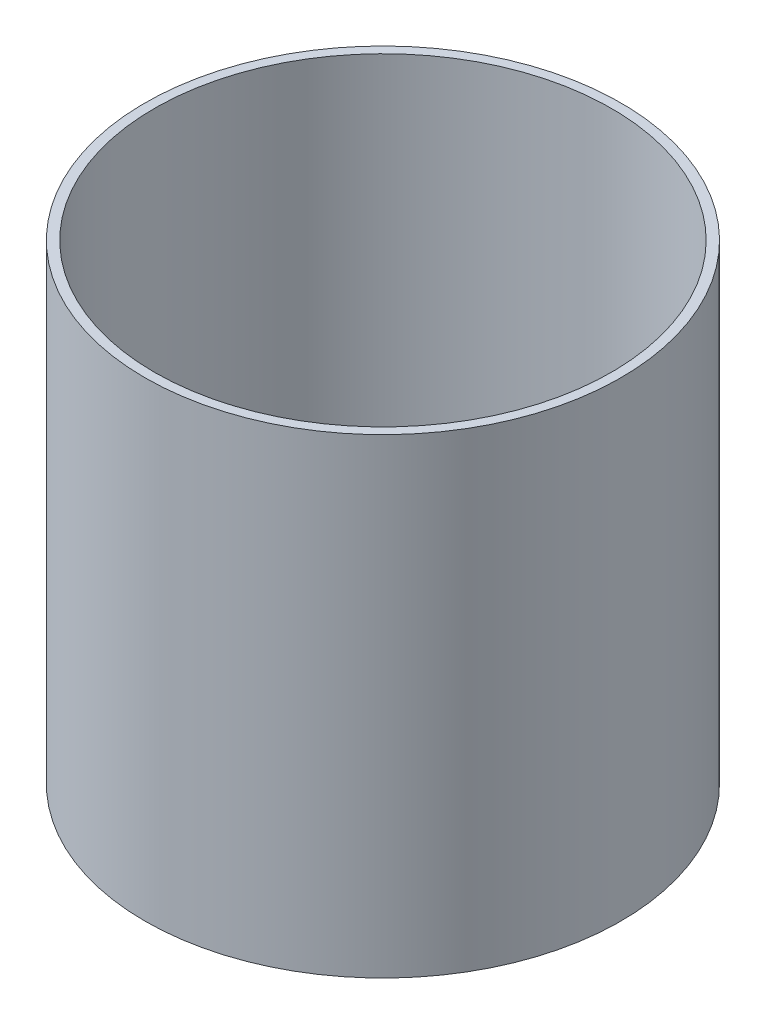
ISO-10303-21;
HEADER;
FILE_DESCRIPTION(('STEP AP214'),'2;1');
FILE_NAME('part.step','',(''),(''),'','','');
FILE_SCHEMA(('AUTOMOTIVE_DESIGN { 1 0 10303 214 1 1 1 1 }'));
ENDSEC;
DATA;
#1=APPLICATION_CONTEXT('core data for automotive mechanical design processes');
#2=APPLICATION_PROTOCOL_DEFINITION('international standard','automotive_design',2000,#1);
#3=PRODUCT_CONTEXT('',#1,'mechanical');
#4=PRODUCT('Part','Part','',(#3));
#5=PRODUCT_RELATED_PRODUCT_CATEGORY('part','',(#4));
#6=PRODUCT_DEFINITION_FORMATION('','',#4);
#7=PRODUCT_DEFINITION_CONTEXT('part definition',#1,'design');
#8=PRODUCT_DEFINITION('design','',#6,#7);
#9=PRODUCT_DEFINITION_SHAPE('','',#8);
#10=(LENGTH_UNIT() NAMED_UNIT(*) SI_UNIT(.MILLI.,.METRE.));
#11=(NAMED_UNIT(*) PLANE_ANGLE_UNIT() SI_UNIT($,.RADIAN.));
#12=(NAMED_UNIT(*) SI_UNIT($,.STERADIAN.) SOLID_ANGLE_UNIT());
#13=UNCERTAINTY_MEASURE_WITH_UNIT(LENGTH_MEASURE(1.E-05),#10,'distance_accuracy_value','');
#14=(GEOMETRIC_REPRESENTATION_CONTEXT(3) GLOBAL_UNCERTAINTY_ASSIGNED_CONTEXT((#13)) GLOBAL_UNIT_ASSIGNED_CONTEXT((#10,
#11,#12)) REPRESENTATION_CONTEXT('',''));
#15=CARTESIAN_POINT('',(0.,0.,0.));
#16=DIRECTION('',(0.,0.,1.));
#17=DIRECTION('',(1.,0.,0.));
#18=AXIS2_PLACEMENT_3D('',#15,#16,#17);
#19=CARTESIAN_POINT('',(0.,113.,0.));
#20=DIRECTION('',(0.,-1.,0.));
#21=DIRECTION('',(0.,0.,-1.));
#22=AXIS2_PLACEMENT_3D('',#19,#20,#21);
#23=CYLINDRICAL_SURFACE('',#22,57.15);
#24=CARTESIAN_POINT('',(0.,113.,0.));
#25=DIRECTION('',(0.,1.,0.));
#26=DIRECTION('',(0.,0.,1.));
#27=AXIS2_PLACEMENT_3D('',#24,#25,#26);
#28=CIRCLE('',#27,57.15);
#29=CARTESIAN_POINT('',(0.,113.,57.15));
#30=VERTEX_POINT('',#29);
#31=EDGE_CURVE('E10',#30,#30,#28,.T.);
#32=ORIENTED_EDGE('',*,*,#31,.F.);
#33=EDGE_LOOP('',(#32));
#34=FACE_BOUND('',#33,.T.);
#35=CARTESIAN_POINT('',(0.,0.,0.));
#36=DIRECTION('',(0.,1.,0.));
#37=DIRECTION('',(0.,0.,1.));
#38=AXIS2_PLACEMENT_3D('',#35,#36,#37);
#39=CIRCLE('',#38,57.15);
#40=CARTESIAN_POINT('',(0.,0.,57.15));
#41=VERTEX_POINT('',#40);
#42=EDGE_CURVE('E44',#41,#41,#39,.T.);
#43=ORIENTED_EDGE('',*,*,#42,.T.);
#44=EDGE_LOOP('',(#43));
#45=FACE_BOUND('',#44,.T.);
#46=ADVANCED_FACE('F41',(#34,#45),#23,.T.);
#47=CARTESIAN_POINT('',(0.,113.,0.));
#48=DIRECTION('',(0.,1.,0.));
#49=DIRECTION('',(0.,0.,1.));
#50=AXIS2_PLACEMENT_3D('',#47,#48,#49);
#51=PLANE('',#50);
#52=CARTESIAN_POINT('',(0.,113.,0.));
#53=DIRECTION('',(0.,1.,0.));
#54=DIRECTION('',(0.,0.,1.));
#55=AXIS2_PLACEMENT_3D('',#52,#53,#54);
#56=CIRCLE('',#55,54.8814901991703);
#57=CARTESIAN_POINT('',(0.,113.,54.8814901991703));
#58=VERTEX_POINT('',#57);
#59=EDGE_CURVE('E53',#58,#58,#56,.T.);
#60=ORIENTED_EDGE('',*,*,#59,.F.);
#61=EDGE_LOOP('',(#60));
#62=FACE_BOUND('',#61,.T.);
#63=ORIENTED_EDGE('',*,*,#31,.T.);
#64=EDGE_LOOP('',(#63));
#65=FACE_BOUND('',#64,.T.);
#66=ADVANCED_FACE('F68',(#62,#65),#51,.T.);
#67=CARTESIAN_POINT('',(0.,0.,0.));
#68=DIRECTION('',(0.,1.,0.));
#69=DIRECTION('',(0.,0.,1.));
#70=AXIS2_PLACEMENT_3D('',#67,#68,#69);
#71=PLANE('',#70);
#72=ORIENTED_EDGE('',*,*,#42,.F.);
#73=EDGE_LOOP('',(#72));
#74=FACE_BOUND('',#73,.T.);
#75=ADVANCED_FACE('F64',(#74),#71,.F.);
#76=CARTESIAN_POINT('',(0.,4.00000000000003,0.));
#77=DIRECTION('',(0.,1.,0.));
#78=DIRECTION('',(0.,0.,1.));
#79=AXIS2_PLACEMENT_3D('',#76,#77,#78);
#80=CYLINDRICAL_SURFACE('',#79,54.8814901991703);
#81=CARTESIAN_POINT('',(0.,4.00000000000003,0.));
#82=DIRECTION('',(0.,1.,0.));
#83=DIRECTION('',(0.,0.,1.));
#84=AXIS2_PLACEMENT_3D('',#81,#82,#83);
#85=CIRCLE('',#84,54.8814901991703);
#86=CARTESIAN_POINT('',(0.,4.00000000000003,54.8814901991703));
#87=VERTEX_POINT('',#86);
#88=EDGE_CURVE('E51',#87,#87,#85,.T.);
#89=ORIENTED_EDGE('',*,*,#88,.F.);
#90=EDGE_LOOP('',(#89));
#91=FACE_BOUND('',#90,.T.);
#92=ORIENTED_EDGE('',*,*,#59,.T.);
#93=EDGE_LOOP('',(#92));
#94=FACE_BOUND('',#93,.T.);
#95=ADVANCED_FACE('F61',(#91,#94),#80,.F.);
#96=CARTESIAN_POINT('',(0.,4.00000000000003,0.));
#97=DIRECTION('',(0.,1.,0.));
#98=DIRECTION('',(0.,0.,1.));
#99=AXIS2_PLACEMENT_3D('',#96,#97,#98);
#100=PLANE('',#99);
#101=ORIENTED_EDGE('',*,*,#88,.T.);
#102=EDGE_LOOP('',(#101));
#103=FACE_BOUND('',#102,.T.);
#104=ADVANCED_FACE('F59',(#103),#100,.T.);
#105=CLOSED_SHELL('',(#46,#66,#75,#95,#104));
#106=MANIFOLD_SOLID_BREP('B2',#105);
#107=ADVANCED_BREP_SHAPE_REPRESENTATION('',(#18,#106),#14);
#108=SHAPE_DEFINITION_REPRESENTATION(#9,#107);
ENDSEC;
END-ISO-10303-21;
